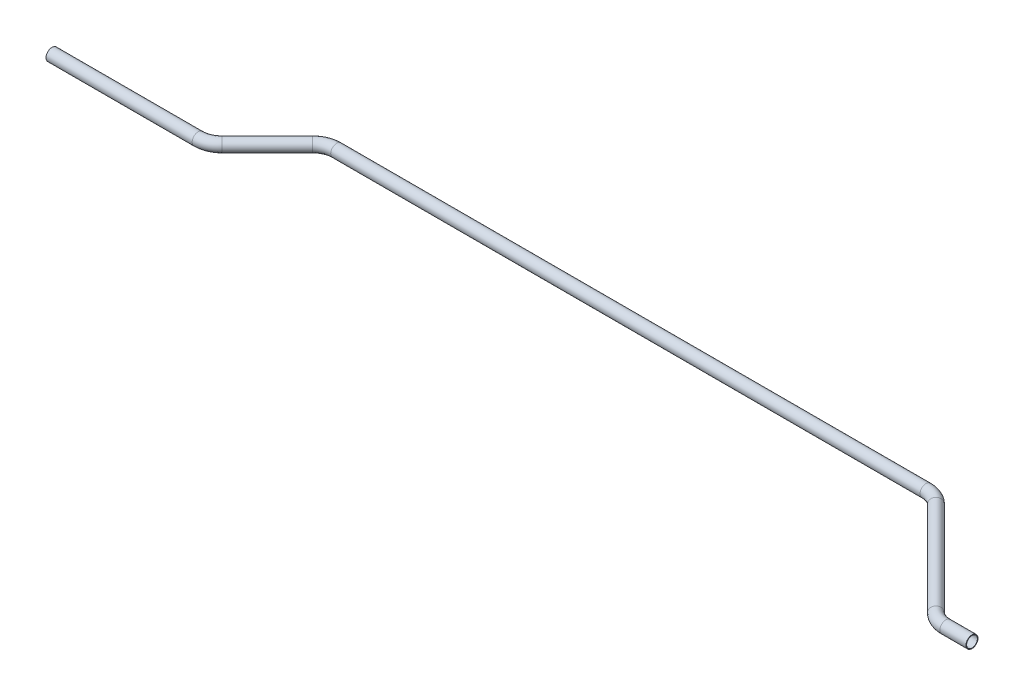
ISO-10303-21;
HEADER;
FILE_DESCRIPTION(('STEP AP214'),'2;1');
FILE_NAME('part.step','',(''),(''),'','','');
FILE_SCHEMA(('AUTOMOTIVE_DESIGN { 1 0 10303 214 1 1 1 1 }'));
ENDSEC;
DATA;
#1=APPLICATION_CONTEXT('core data for automotive mechanical design processes');
#2=APPLICATION_PROTOCOL_DEFINITION('international standard','automotive_design',2000,#1);
#3=PRODUCT_CONTEXT('',#1,'mechanical');
#4=PRODUCT('Part','Part','',(#3));
#5=PRODUCT_RELATED_PRODUCT_CATEGORY('part','',(#4));
#6=PRODUCT_DEFINITION_FORMATION('','',#4);
#7=PRODUCT_DEFINITION_CONTEXT('part definition',#1,'design');
#8=PRODUCT_DEFINITION('design','',#6,#7);
#9=PRODUCT_DEFINITION_SHAPE('','',#8);
#10=(LENGTH_UNIT() NAMED_UNIT(*) SI_UNIT(.MILLI.,.METRE.));
#11=(NAMED_UNIT(*) PLANE_ANGLE_UNIT() SI_UNIT($,.RADIAN.));
#12=(NAMED_UNIT(*) SI_UNIT($,.STERADIAN.) SOLID_ANGLE_UNIT());
#13=UNCERTAINTY_MEASURE_WITH_UNIT(LENGTH_MEASURE(1.E-05),#10,'distance_accuracy_value','');
#14=(GEOMETRIC_REPRESENTATION_CONTEXT(3) GLOBAL_UNCERTAINTY_ASSIGNED_CONTEXT((#13)) GLOBAL_UNIT_ASSIGNED_CONTEXT((#10,
#11,#12)) REPRESENTATION_CONTEXT('',''));
#15=CARTESIAN_POINT('',(0.,0.,0.));
#16=DIRECTION('',(0.,0.,1.));
#17=DIRECTION('',(1.,0.,0.));
#18=AXIS2_PLACEMENT_3D('',#15,#16,#17);
#19=CARTESIAN_POINT('',(0.,0.,0.));
#20=DIRECTION('',(1.,0.,0.));
#21=DIRECTION('',(0.,0.,-1.));
#22=AXIS2_PLACEMENT_3D('',#19,#20,#21);
#23=CYLINDRICAL_SURFACE('',#22,6.35);
#24=CARTESIAN_POINT('',(154.578975515723,0.,0.));
#25=DIRECTION('',(1.,0.,0.));
#26=DIRECTION('',(0.,0.,-1.));
#27=AXIS2_PLACEMENT_3D('',#24,#25,#26);
#28=CIRCLE('',#27,6.35);
#29=CARTESIAN_POINT('',(154.578975515723,0.,6.35000000000002));
#30=VERTEX_POINT('',#29);
#31=EDGE_CURVE('E60',#30,#30,#28,.T.);
#32=ORIENTED_EDGE('',*,*,#31,.F.);
#33=EDGE_LOOP('',(#32));
#34=FACE_BOUND('',#33,.T.);
#35=CARTESIAN_POINT('',(0.,0.,0.));
#36=DIRECTION('',(1.,0.,0.));
#37=DIRECTION('',(0.,0.,-1.));
#38=AXIS2_PLACEMENT_3D('',#35,#36,#37);
#39=CIRCLE('',#38,6.35);
#40=CARTESIAN_POINT('',(0.,0.,-6.35));
#41=VERTEX_POINT('',#40);
#42=EDGE_CURVE('E57',#41,#41,#39,.T.);
#43=ORIENTED_EDGE('',*,*,#42,.T.);
#44=EDGE_LOOP('',(#43));
#45=FACE_BOUND('',#44,.T.);
#46=ADVANCED_FACE('F36',(#34,#45),#23,.T.);
#47=CARTESIAN_POINT('',(154.578975515723,0.,-25.4));
#48=DIRECTION('',(0.,1.,0.));
#49=DIRECTION('',(0.,0.,1.));
#50=AXIS2_PLACEMENT_3D('',#47,#48,#49);
#51=TOROIDAL_SURFACE('',#50,25.4,6.35);
#52=CARTESIAN_POINT('',(172.539487757862,0.,-7.43948775786174));
#53=DIRECTION('',(0.707106781186545,0.,-0.70710678118655));
#54=DIRECTION('',(-0.70710678118655,0.,-0.707106781186545));
#55=AXIS2_PLACEMENT_3D('',#52,#53,#54);
#56=CIRCLE('',#55,6.35);
#57=CARTESIAN_POINT('',(177.029615818396,0.,-2.94935969732717));
#58=VERTEX_POINT('',#57);
#59=EDGE_CURVE('E63',#58,#58,#56,.T.);
#60=CARTESIAN_POINT('',(154.578975515723,0.,-25.4));
#61=DIRECTION('',(0.,1.,0.));
#62=DIRECTION('',(0.,0.,1.));
#63=AXIS2_PLACEMENT_3D('',#60,#61,#62);
#64=CIRCLE('',#63,31.75);
#65=EDGE_CURVE('',#30,#58,#64,.T.);
#66=ORIENTED_EDGE('',*,*,#31,.T.);
#67=ORIENTED_EDGE('',*,*,#59,.F.);
#68=ORIENTED_EDGE('',*,*,#65,.T.);
#69=ORIENTED_EDGE('',*,*,#65,.F.);
#70=EDGE_LOOP('',(#66,#68,#67,#69));
#71=FACE_BOUND('',#70,.T.);
#72=ADVANCED_FACE('F120',(#71),#51,.T.);
#73=CARTESIAN_POINT('',(172.539487757862,0.,-7.43948775786172));
#74=DIRECTION('',(0.707106781186545,0.,-0.70710678118655));
#75=DIRECTION('',(-0.70710678118655,0.,-0.707106781186545));
#76=AXIS2_PLACEMENT_3D('',#73,#74,#75);
#77=CYLINDRICAL_SURFACE('',#76,6.35);
#78=CARTESIAN_POINT('',(220.398512242138,0.,-55.2985122421383));
#79=DIRECTION('',(0.707106781186545,0.,-0.70710678118655));
#80=DIRECTION('',(-0.70710678118655,0.,-0.707106781186545));
#81=AXIS2_PLACEMENT_3D('',#78,#79,#80);
#82=CIRCLE('',#81,6.35);
#83=CARTESIAN_POINT('',(215.908384181603,0.,-59.7886403026728));
#84=VERTEX_POINT('',#83);
#85=EDGE_CURVE('E66',#84,#84,#82,.T.);
#86=ORIENTED_EDGE('',*,*,#85,.F.);
#87=EDGE_LOOP('',(#86));
#88=FACE_BOUND('',#87,.T.);
#89=ORIENTED_EDGE('',*,*,#59,.T.);
#90=EDGE_LOOP('',(#89));
#91=FACE_BOUND('',#90,.T.);
#92=ADVANCED_FACE('F124',(#88,#91),#77,.T.);
#93=CARTESIAN_POINT('',(238.359024484276,0.,-37.338));
#94=DIRECTION('',(0.,-1.,0.));
#95=DIRECTION('',(0.,0.,-1.));
#96=AXIS2_PLACEMENT_3D('',#93,#94,#95);
#97=TOROIDAL_SURFACE('',#96,25.4,6.35);
#98=CARTESIAN_POINT('',(238.359024484276,0.,-62.738));
#99=DIRECTION('',(1.,0.,0.));
#100=DIRECTION('',(0.,0.,-1.));
#101=AXIS2_PLACEMENT_3D('',#98,#99,#100);
#102=CIRCLE('',#101,6.35);
#103=CARTESIAN_POINT('',(238.359024484276,0.,-69.088));
#104=VERTEX_POINT('',#103);
#105=EDGE_CURVE('E69',#104,#104,#102,.T.);
#106=CARTESIAN_POINT('',(238.359024484276,0.,-37.338));
#107=DIRECTION('',(0.,-1.,0.));
#108=DIRECTION('',(0.,0.,-1.));
#109=AXIS2_PLACEMENT_3D('',#106,#107,#108);
#110=CIRCLE('',#109,31.75);
#111=EDGE_CURVE('',#84,#104,#110,.T.);
#112=ORIENTED_EDGE('',*,*,#85,.T.);
#113=ORIENTED_EDGE('',*,*,#105,.F.);
#114=ORIENTED_EDGE('',*,*,#111,.T.);
#115=ORIENTED_EDGE('',*,*,#111,.F.);
#116=EDGE_LOOP('',(#112,#114,#113,#115));
#117=FACE_BOUND('',#116,.T.);
#118=ADVANCED_FACE('F128',(#117),#97,.T.);
#119=CARTESIAN_POINT('',(238.359024484276,0.,-62.738));
#120=DIRECTION('',(1.,0.,0.));
#121=DIRECTION('',(0.,0.,-1.));
#122=AXIS2_PLACEMENT_3D('',#119,#120,#121);
#123=CYLINDRICAL_SURFACE('',#122,6.35);
#124=CARTESIAN_POINT('',(861.517480355723,0.,-62.738));
#125=DIRECTION('',(1.,0.,0.));
#126=DIRECTION('',(0.,0.,-1.));
#127=AXIS2_PLACEMENT_3D('',#124,#125,#126);
#128=CIRCLE('',#127,6.35);
#129=CARTESIAN_POINT('',(861.517480355723,0.,-69.088));
#130=VERTEX_POINT('',#129);
#131=EDGE_CURVE('E72',#130,#130,#128,.T.);
#132=ORIENTED_EDGE('',*,*,#131,.F.);
#133=EDGE_LOOP('',(#132));
#134=FACE_BOUND('',#133,.T.);
#135=ORIENTED_EDGE('',*,*,#105,.T.);
#136=EDGE_LOOP('',(#135));
#137=FACE_BOUND('',#136,.T.);
#138=ADVANCED_FACE('F132',(#134,#137),#123,.T.);
#139=CARTESIAN_POINT('',(861.517480355723,0.,-37.338));
#140=DIRECTION('',(0.,-1.,0.));
#141=DIRECTION('',(0.,0.,-1.));
#142=AXIS2_PLACEMENT_3D('',#139,#140,#141);
#143=TOROIDAL_SURFACE('',#142,25.4,6.35);
#144=CARTESIAN_POINT('',(879.477992597861,0.,-55.2985122421384));
#145=DIRECTION('',(0.70710678118655,0.,0.707106781186545));
#146=DIRECTION('',(0.707106781186545,0.,-0.70710678118655));
#147=AXIS2_PLACEMENT_3D('',#144,#145,#146);
#148=CIRCLE('',#147,6.35);
#149=CARTESIAN_POINT('',(883.968120658396,0.,-59.788640302673));
#150=VERTEX_POINT('',#149);
#151=EDGE_CURVE('E75',#150,#150,#148,.T.);
#152=CARTESIAN_POINT('',(861.517480355723,0.,-37.338));
#153=DIRECTION('',(0.,-1.,0.));
#154=DIRECTION('',(0.,0.,-1.));
#155=AXIS2_PLACEMENT_3D('',#152,#153,#154);
#156=CIRCLE('',#155,31.75);
#157=EDGE_CURVE('',#130,#150,#156,.T.);
#158=ORIENTED_EDGE('',*,*,#131,.T.);
#159=ORIENTED_EDGE('',*,*,#151,.F.);
#160=ORIENTED_EDGE('',*,*,#157,.T.);
#161=ORIENTED_EDGE('',*,*,#157,.F.);
#162=EDGE_LOOP('',(#158,#160,#159,#161));
#163=FACE_BOUND('',#162,.T.);
#164=ADVANCED_FACE('F94',(#163),#143,.T.);
#165=CARTESIAN_POINT('',(879.477992597861,0.,-55.2985122421384));
#166=DIRECTION('',(0.70710678118655,0.,0.707106781186545));
#167=DIRECTION('',(0.707106781186545,0.,-0.70710678118655));
#168=AXIS2_PLACEMENT_3D('',#165,#166,#167);
#169=CYLINDRICAL_SURFACE('',#168,6.35);
#170=CARTESIAN_POINT('',(978.899017082139,0.,44.1225122421387));
#171=DIRECTION('',(0.70710678118655,0.,0.707106781186545));
#172=DIRECTION('',(0.707106781186545,0.,-0.70710678118655));
#173=AXIS2_PLACEMENT_3D('',#170,#171,#172);
#174=CIRCLE('',#173,6.35);
#175=CARTESIAN_POINT('',(974.408889021605,0.,48.6126403026733));
#176=VERTEX_POINT('',#175);
#177=EDGE_CURVE('E77',#176,#176,#174,.T.);
#178=ORIENTED_EDGE('',*,*,#177,.F.);
#179=EDGE_LOOP('',(#178));
#180=FACE_BOUND('',#179,.T.);
#181=ORIENTED_EDGE('',*,*,#151,.T.);
#182=EDGE_LOOP('',(#181));
#183=FACE_BOUND('',#182,.T.);
#184=ADVANCED_FACE('F87',(#180,#183),#169,.T.);
#185=CARTESIAN_POINT('',(996.859529324277,0.,26.1620000000003));
#186=DIRECTION('',(0.,1.,0.));
#187=DIRECTION('',(0.,0.,1.));
#188=AXIS2_PLACEMENT_3D('',#185,#186,#187);
#189=TOROIDAL_SURFACE('',#188,25.4,6.35);
#190=CARTESIAN_POINT('',(996.859529324277,0.,51.5620000000003));
#191=DIRECTION('',(1.,0.,0.));
#192=DIRECTION('',(0.,0.,-1.));
#193=AXIS2_PLACEMENT_3D('',#190,#191,#192);
#194=CIRCLE('',#193,6.35);
#195=CARTESIAN_POINT('',(996.859529324277,0.,57.9120000000003));
#196=VERTEX_POINT('',#195);
#197=EDGE_CURVE('E40',#196,#196,#194,.T.);
#198=CARTESIAN_POINT('',(996.859529324277,0.,26.1620000000003));
#199=DIRECTION('',(0.,1.,0.));
#200=DIRECTION('',(0.,0.,1.));
#201=AXIS2_PLACEMENT_3D('',#198,#199,#200);
#202=CIRCLE('',#201,31.75);
#203=EDGE_CURVE('',#176,#196,#202,.T.);
#204=ORIENTED_EDGE('',*,*,#177,.T.);
#205=ORIENTED_EDGE('',*,*,#197,.F.);
#206=ORIENTED_EDGE('',*,*,#203,.T.);
#207=ORIENTED_EDGE('',*,*,#203,.F.);
#208=EDGE_LOOP('',(#204,#206,#205,#207));
#209=FACE_BOUND('',#208,.T.);
#210=ADVANCED_FACE('F85',(#209),#189,.T.);
#211=CARTESIAN_POINT('',(996.859529324277,0.,51.5620000000003));
#212=DIRECTION('',(1.,0.,0.));
#213=DIRECTION('',(0.,0.,-1.));
#214=AXIS2_PLACEMENT_3D('',#211,#212,#213);
#215=CYLINDRICAL_SURFACE('',#214,6.35);
#216=CARTESIAN_POINT('',(1024.43850484,0.,51.5620000000003));
#217=DIRECTION('',(1.,0.,0.));
#218=DIRECTION('',(0.,0.,-1.));
#219=AXIS2_PLACEMENT_3D('',#216,#217,#218);
#220=CIRCLE('',#219,6.35);
#221=CARTESIAN_POINT('',(1024.43850484,0.,45.2120000000003));
#222=VERTEX_POINT('',#221);
#223=EDGE_CURVE('E53',#222,#222,#220,.T.);
#224=ORIENTED_EDGE('',*,*,#223,.F.);
#225=EDGE_LOOP('',(#224));
#226=FACE_BOUND('',#225,.T.);
#227=ORIENTED_EDGE('',*,*,#197,.T.);
#228=EDGE_LOOP('',(#227));
#229=FACE_BOUND('',#228,.T.);
#230=ADVANCED_FACE('F38',(#226,#229),#215,.T.);
#231=CARTESIAN_POINT('',(0.,0.,0.));
#232=DIRECTION('',(1.,0.,0.));
#233=DIRECTION('',(0.,0.,-1.));
#234=AXIS2_PLACEMENT_3D('',#231,#232,#233);
#235=PLANE('',#234);
#236=CARTESIAN_POINT('',(0.,0.,0.));
#237=DIRECTION('',(1.,0.,0.));
#238=DIRECTION('',(0.,0.,-1.));
#239=AXIS2_PLACEMENT_3D('',#236,#237,#238);
#240=CIRCLE('',#239,5.715);
#241=CARTESIAN_POINT('',(0.,0.,-5.715));
#242=VERTEX_POINT('',#241);
#243=EDGE_CURVE('E56',#242,#242,#240,.F.);
#244=ORIENTED_EDGE('',*,*,#243,.F.);
#245=EDGE_LOOP('',(#244));
#246=FACE_BOUND('',#245,.T.);
#247=ORIENTED_EDGE('',*,*,#42,.F.);
#248=EDGE_LOOP('',(#247));
#249=FACE_BOUND('',#248,.T.);
#250=ADVANCED_FACE('F92',(#246,#249),#235,.F.);
#251=CARTESIAN_POINT('',(1024.43850484,0.,51.5620000000003));
#252=DIRECTION('',(1.,0.,0.));
#253=DIRECTION('',(0.,0.,-1.));
#254=AXIS2_PLACEMENT_3D('',#251,#252,#253);
#255=PLANE('',#254);
#256=CARTESIAN_POINT('',(1024.43850484,0.,51.5620000000003));
#257=DIRECTION('',(1.,0.,0.));
#258=DIRECTION('',(0.,0.,-1.));
#259=AXIS2_PLACEMENT_3D('',#256,#257,#258);
#260=CIRCLE('',#259,5.715);
#261=CARTESIAN_POINT('',(1024.43850484,0.,45.8470000000003));
#262=VERTEX_POINT('',#261);
#263=EDGE_CURVE('E10',#262,#262,#260,.F.);
#264=ORIENTED_EDGE('',*,*,#263,.T.);
#265=EDGE_LOOP('',(#264));
#266=FACE_BOUND('',#265,.T.);
#267=ORIENTED_EDGE('',*,*,#223,.T.);
#268=EDGE_LOOP('',(#267));
#269=FACE_BOUND('',#268,.T.);
#270=ADVANCED_FACE('F111',(#266,#269),#255,.T.);
#271=CARTESIAN_POINT('',(0.,0.,0.));
#272=DIRECTION('',(1.,0.,0.));
#273=DIRECTION('',(0.,0.,-1.));
#274=AXIS2_PLACEMENT_3D('',#271,#272,#273);
#275=CYLINDRICAL_SURFACE('',#274,5.715);
#276=CARTESIAN_POINT('',(154.578975515723,0.,0.));
#277=DIRECTION('',(1.,0.,0.));
#278=DIRECTION('',(0.,0.,-1.));
#279=AXIS2_PLACEMENT_3D('',#276,#277,#278);
#280=CIRCLE('',#279,5.715);
#281=CARTESIAN_POINT('',(154.578975515723,0.,5.71500000000002));
#282=VERTEX_POINT('',#281);
#283=EDGE_CURVE('E285',#282,#282,#280,.F.);
#284=ORIENTED_EDGE('',*,*,#283,.F.);
#285=EDGE_LOOP('',(#284));
#286=FACE_BOUND('',#285,.T.);
#287=ORIENTED_EDGE('',*,*,#243,.T.);
#288=EDGE_LOOP('',(#287));
#289=FACE_BOUND('',#288,.T.);
#290=ADVANCED_FACE('F114',(#286,#289),#275,.F.);
#291=CARTESIAN_POINT('',(154.578975515723,0.,-25.4));
#292=DIRECTION('',(0.,1.,0.));
#293=DIRECTION('',(0.,0.,1.));
#294=AXIS2_PLACEMENT_3D('',#291,#292,#293);
#295=TOROIDAL_SURFACE('',#294,25.4,5.715);
#296=CARTESIAN_POINT('',(172.539487757862,0.,-7.43948775786174));
#297=DIRECTION('',(0.707106781186545,0.,-0.70710678118655));
#298=DIRECTION('',(-0.70710678118655,0.,-0.707106781186545));
#299=AXIS2_PLACEMENT_3D('',#296,#297,#298);
#300=CIRCLE('',#299,5.715);
#301=CARTESIAN_POINT('',(176.580603012343,0.,-3.39837250338063));
#302=VERTEX_POINT('',#301);
#303=EDGE_CURVE('E282',#302,#302,#300,.F.);
#304=CARTESIAN_POINT('',(154.578975515723,0.,-25.4));
#305=DIRECTION('',(0.,1.,0.));
#306=DIRECTION('',(0.,0.,1.));
#307=AXIS2_PLACEMENT_3D('',#304,#305,#306);
#308=CIRCLE('',#307,31.115);
#309=EDGE_CURVE('',#282,#302,#308,.T.);
#310=ORIENTED_EDGE('',*,*,#283,.T.);
#311=ORIENTED_EDGE('',*,*,#303,.F.);
#312=ORIENTED_EDGE('',*,*,#309,.T.);
#313=ORIENTED_EDGE('',*,*,#309,.F.);
#314=EDGE_LOOP('',(#310,#312,#311,#313));
#315=FACE_BOUND('',#314,.T.);
#316=ADVANCED_FACE('F193',(#315),#295,.F.);
#317=CARTESIAN_POINT('',(172.539487757862,0.,-7.43948775786172));
#318=DIRECTION('',(0.707106781186545,0.,-0.70710678118655));
#319=DIRECTION('',(-0.70710678118655,0.,-0.707106781186545));
#320=AXIS2_PLACEMENT_3D('',#317,#318,#319);
#321=CYLINDRICAL_SURFACE('',#320,5.715);
#322=CARTESIAN_POINT('',(220.398512242138,0.,-55.2985122421383));
#323=DIRECTION('',(0.707106781186545,0.,-0.70710678118655));
#324=DIRECTION('',(-0.70710678118655,0.,-0.707106781186545));
#325=AXIS2_PLACEMENT_3D('',#322,#323,#324);
#326=CIRCLE('',#325,5.715);
#327=CARTESIAN_POINT('',(216.357396987657,0.,-59.3396274966194));
#328=VERTEX_POINT('',#327);
#329=EDGE_CURVE('E279',#328,#328,#326,.F.);
#330=ORIENTED_EDGE('',*,*,#329,.F.);
#331=EDGE_LOOP('',(#330));
#332=FACE_BOUND('',#331,.T.);
#333=ORIENTED_EDGE('',*,*,#303,.T.);
#334=EDGE_LOOP('',(#333));
#335=FACE_BOUND('',#334,.T.);
#336=ADVANCED_FACE('F203',(#332,#335),#321,.F.);
#337=CARTESIAN_POINT('',(238.359024484276,0.,-37.338));
#338=DIRECTION('',(0.,-1.,0.));
#339=DIRECTION('',(0.,0.,-1.));
#340=AXIS2_PLACEMENT_3D('',#337,#338,#339);
#341=TOROIDAL_SURFACE('',#340,25.4,5.715);
#342=CARTESIAN_POINT('',(238.359024484276,0.,-62.738));
#343=DIRECTION('',(1.,0.,0.));
#344=DIRECTION('',(0.,0.,-1.));
#345=AXIS2_PLACEMENT_3D('',#342,#343,#344);
#346=CIRCLE('',#345,5.715);
#347=CARTESIAN_POINT('',(238.359024484276,0.,-68.453));
#348=VERTEX_POINT('',#347);
#349=EDGE_CURVE('E274',#348,#348,#346,.F.);
#350=CARTESIAN_POINT('',(238.359024484276,0.,-37.338));
#351=DIRECTION('',(0.,-1.,0.));
#352=DIRECTION('',(0.,0.,-1.));
#353=AXIS2_PLACEMENT_3D('',#350,#351,#352);
#354=CIRCLE('',#353,31.115);
#355=EDGE_CURVE('',#328,#348,#354,.T.);
#356=ORIENTED_EDGE('',*,*,#329,.T.);
#357=ORIENTED_EDGE('',*,*,#349,.F.);
#358=ORIENTED_EDGE('',*,*,#355,.T.);
#359=ORIENTED_EDGE('',*,*,#355,.F.);
#360=EDGE_LOOP('',(#356,#358,#357,#359));
#361=FACE_BOUND('',#360,.T.);
#362=ADVANCED_FACE('F213',(#361),#341,.F.);
#363=CARTESIAN_POINT('',(238.359024484276,0.,-62.738));
#364=DIRECTION('',(1.,0.,0.));
#365=DIRECTION('',(0.,0.,-1.));
#366=AXIS2_PLACEMENT_3D('',#363,#364,#365);
#367=CYLINDRICAL_SURFACE('',#366,5.715);
#368=CARTESIAN_POINT('',(861.517480355723,0.,-62.738));
#369=DIRECTION('',(1.,0.,0.));
#370=DIRECTION('',(0.,0.,-1.));
#371=AXIS2_PLACEMENT_3D('',#368,#369,#370);
#372=CIRCLE('',#371,5.715);
#373=CARTESIAN_POINT('',(861.517480355723,0.,-68.453));
#374=VERTEX_POINT('',#373);
#375=EDGE_CURVE('E271',#374,#374,#372,.F.);
#376=ORIENTED_EDGE('',*,*,#375,.F.);
#377=EDGE_LOOP('',(#376));
#378=FACE_BOUND('',#377,.T.);
#379=ORIENTED_EDGE('',*,*,#349,.T.);
#380=EDGE_LOOP('',(#379));
#381=FACE_BOUND('',#380,.T.);
#382=ADVANCED_FACE('F223',(#378,#381),#367,.F.);
#383=CARTESIAN_POINT('',(861.517480355723,0.,-37.338));
#384=DIRECTION('',(0.,-1.,0.));
#385=DIRECTION('',(0.,0.,-1.));
#386=AXIS2_PLACEMENT_3D('',#383,#384,#385);
#387=TOROIDAL_SURFACE('',#386,25.4,5.715);
#388=CARTESIAN_POINT('',(879.477992597861,0.,-55.2985122421384));
#389=DIRECTION('',(0.70710678118655,0.,0.707106781186545));
#390=DIRECTION('',(0.707106781186545,0.,-0.70710678118655));
#391=AXIS2_PLACEMENT_3D('',#388,#389,#390);
#392=CIRCLE('',#391,5.715);
#393=CARTESIAN_POINT('',(883.519107852342,0.,-59.3396274966195));
#394=VERTEX_POINT('',#393);
#395=EDGE_CURVE('E270',#394,#394,#392,.F.);
#396=CARTESIAN_POINT('',(861.517480355723,0.,-37.338));
#397=DIRECTION('',(0.,-1.,0.));
#398=DIRECTION('',(0.,0.,-1.));
#399=AXIS2_PLACEMENT_3D('',#396,#397,#398);
#400=CIRCLE('',#399,31.115);
#401=EDGE_CURVE('',#374,#394,#400,.T.);
#402=ORIENTED_EDGE('',*,*,#375,.T.);
#403=ORIENTED_EDGE('',*,*,#395,.F.);
#404=ORIENTED_EDGE('',*,*,#401,.T.);
#405=ORIENTED_EDGE('',*,*,#401,.F.);
#406=EDGE_LOOP('',(#402,#404,#403,#405));
#407=FACE_BOUND('',#406,.T.);
#408=ADVANCED_FACE('F233',(#407),#387,.F.);
#409=CARTESIAN_POINT('',(879.477992597861,0.,-55.2985122421384));
#410=DIRECTION('',(0.70710678118655,0.,0.707106781186545));
#411=DIRECTION('',(0.707106781186545,0.,-0.70710678118655));
#412=AXIS2_PLACEMENT_3D('',#409,#410,#411);
#413=CYLINDRICAL_SURFACE('',#412,5.715);
#414=CARTESIAN_POINT('',(978.899017082139,0.,44.1225122421387));
#415=DIRECTION('',(0.70710678118655,0.,0.707106781186545));
#416=DIRECTION('',(0.707106781186545,0.,-0.70710678118655));
#417=AXIS2_PLACEMENT_3D('',#414,#415,#416);
#418=CIRCLE('',#417,5.715);
#419=CARTESIAN_POINT('',(974.857901827658,0.,48.1636274966198));
#420=VERTEX_POINT('',#419);
#421=EDGE_CURVE('E49',#420,#420,#418,.F.);
#422=ORIENTED_EDGE('',*,*,#421,.F.);
#423=EDGE_LOOP('',(#422));
#424=FACE_BOUND('',#423,.T.);
#425=ORIENTED_EDGE('',*,*,#395,.T.);
#426=EDGE_LOOP('',(#425));
#427=FACE_BOUND('',#426,.T.);
#428=ADVANCED_FACE('F105',(#424,#427),#413,.F.);
#429=CARTESIAN_POINT('',(996.859529324277,0.,26.1620000000003));
#430=DIRECTION('',(0.,1.,0.));
#431=DIRECTION('',(0.,0.,1.));
#432=AXIS2_PLACEMENT_3D('',#429,#430,#431);
#433=TOROIDAL_SURFACE('',#432,25.4,5.715);
#434=CARTESIAN_POINT('',(996.859529324277,0.,51.5620000000003));
#435=DIRECTION('',(1.,0.,0.));
#436=DIRECTION('',(0.,0.,-1.));
#437=AXIS2_PLACEMENT_3D('',#434,#435,#436);
#438=CIRCLE('',#437,5.715);
#439=CARTESIAN_POINT('',(996.859529324277,0.,57.2770000000003));
#440=VERTEX_POINT('',#439);
#441=EDGE_CURVE('E44',#440,#440,#438,.F.);
#442=CARTESIAN_POINT('',(996.859529324277,0.,26.1620000000003));
#443=DIRECTION('',(0.,1.,0.));
#444=DIRECTION('',(0.,0.,1.));
#445=AXIS2_PLACEMENT_3D('',#442,#443,#444);
#446=CIRCLE('',#445,31.115);
#447=EDGE_CURVE('',#420,#440,#446,.T.);
#448=ORIENTED_EDGE('',*,*,#421,.T.);
#449=ORIENTED_EDGE('',*,*,#441,.F.);
#450=ORIENTED_EDGE('',*,*,#447,.T.);
#451=ORIENTED_EDGE('',*,*,#447,.F.);
#452=EDGE_LOOP('',(#448,#450,#449,#451));
#453=FACE_BOUND('',#452,.T.);
#454=ADVANCED_FACE('F99',(#453),#433,.F.);
#455=CARTESIAN_POINT('',(996.859529324277,0.,51.5620000000003));
#456=DIRECTION('',(1.,0.,0.));
#457=DIRECTION('',(0.,0.,-1.));
#458=AXIS2_PLACEMENT_3D('',#455,#456,#457);
#459=CYLINDRICAL_SURFACE('',#458,5.715);
#460=ORIENTED_EDGE('',*,*,#263,.F.);
#461=EDGE_LOOP('',(#460));
#462=FACE_BOUND('',#461,.T.);
#463=ORIENTED_EDGE('',*,*,#441,.T.);
#464=EDGE_LOOP('',(#463));
#465=FACE_BOUND('',#464,.T.);
#466=ADVANCED_FACE('F97',(#462,#465),#459,.F.);
#467=CLOSED_SHELL('',(#46,#72,#92,#118,#138,#164,#184,#210,#230,#250,#270,#290,#316,#336,#362,
#382,#408,#428,#454,#466));
#468=MANIFOLD_SOLID_BREP('B2',#467);
#469=ADVANCED_BREP_SHAPE_REPRESENTATION('',(#18,#468),#14);
#470=SHAPE_DEFINITION_REPRESENTATION(#9,#469);
ENDSEC;
END-ISO-10303-21;
